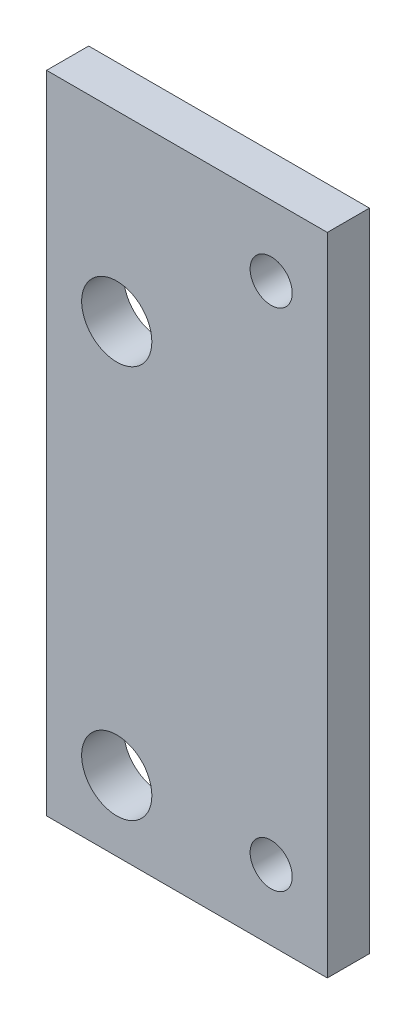
ISO-10303-21;
HEADER;
FILE_DESCRIPTION(('STEP AP214'),'2;1');
FILE_NAME('part.step','',(''),(''),'','','');
FILE_SCHEMA(('AUTOMOTIVE_DESIGN { 1 0 10303 214 1 1 1 1 }'));
ENDSEC;
DATA;
#1=APPLICATION_CONTEXT('core data for automotive mechanical design processes');
#2=APPLICATION_PROTOCOL_DEFINITION('international standard','automotive_design',2000,#1);
#3=PRODUCT_CONTEXT('',#1,'mechanical');
#4=PRODUCT('Part','Part','',(#3));
#5=PRODUCT_RELATED_PRODUCT_CATEGORY('part','',(#4));
#6=PRODUCT_DEFINITION_FORMATION('','',#4);
#7=PRODUCT_DEFINITION_CONTEXT('part definition',#1,'design');
#8=PRODUCT_DEFINITION('design','',#6,#7);
#9=PRODUCT_DEFINITION_SHAPE('','',#8);
#10=(LENGTH_UNIT() NAMED_UNIT(*) SI_UNIT(.MILLI.,.METRE.));
#11=(NAMED_UNIT(*) PLANE_ANGLE_UNIT() SI_UNIT($,.RADIAN.));
#12=(NAMED_UNIT(*) SI_UNIT($,.STERADIAN.) SOLID_ANGLE_UNIT());
#13=UNCERTAINTY_MEASURE_WITH_UNIT(LENGTH_MEASURE(1.E-05),#10,'distance_accuracy_value','');
#14=(GEOMETRIC_REPRESENTATION_CONTEXT(3) GLOBAL_UNCERTAINTY_ASSIGNED_CONTEXT((#13)) GLOBAL_UNIT_ASSIGNED_CONTEXT((#10,
#11,#12)) REPRESENTATION_CONTEXT('',''));
#15=CARTESIAN_POINT('',(0.,0.,0.));
#16=DIRECTION('',(0.,0.,1.));
#17=DIRECTION('',(1.,0.,0.));
#18=AXIS2_PLACEMENT_3D('',#15,#16,#17);
#19=CARTESIAN_POINT('',(0.,46.,3.));
#20=DIRECTION('',(0.,0.,-1.));
#21=DIRECTION('',(-1.,0.,0.));
#22=AXIS2_PLACEMENT_3D('',#19,#20,#21);
#23=PLANE('',#22);
#24=CARTESIAN_POINT('',(16.,41.,3.));
#25=DIRECTION('',(0.,0.,1.));
#26=DIRECTION('',(1.,0.,0.));
#27=AXIS2_PLACEMENT_3D('',#24,#25,#26);
#28=CIRCLE('',#27,1.5);
#29=CARTESIAN_POINT('',(17.5,41.,3.));
#30=VERTEX_POINT('',#29);
#31=EDGE_CURVE('E119',#30,#30,#28,.T.);
#32=ORIENTED_EDGE('',*,*,#31,.F.);
#33=EDGE_LOOP('',(#32));
#34=FACE_BOUND('',#33,.T.);
#35=CARTESIAN_POINT('',(5.,33.,3.));
#36=DIRECTION('',(0.,0.,1.));
#37=DIRECTION('',(1.,0.,0.));
#38=AXIS2_PLACEMENT_3D('',#35,#36,#37);
#39=CIRCLE('',#38,2.5);
#40=CARTESIAN_POINT('',(7.5,33.,3.));
#41=VERTEX_POINT('',#40);
#42=EDGE_CURVE('E98',#41,#41,#39,.T.);
#43=ORIENTED_EDGE('',*,*,#42,.F.);
#44=EDGE_LOOP('',(#43));
#45=FACE_BOUND('',#44,.T.);
#46=DIRECTION('',(0.,-1.,0.));
#47=VECTOR('',#46,1.);
#48=CARTESIAN_POINT('',(0.,0.,3.));
#49=LINE('',#48,#47);
#50=CARTESIAN_POINT('',(0.,46.,3.));
#51=VERTEX_POINT('',#50);
#52=CARTESIAN_POINT('',(0.,0.,3.));
#53=VERTEX_POINT('',#52);
#54=EDGE_CURVE('E83',#51,#53,#49,.T.);
#55=ORIENTED_EDGE('',*,*,#54,.T.);
#56=DIRECTION('',(1.,0.,0.));
#57=VECTOR('',#56,1.);
#58=CARTESIAN_POINT('',(0.,0.,3.));
#59=LINE('',#58,#57);
#60=CARTESIAN_POINT('',(20.,0.,3.));
#61=VERTEX_POINT('',#60);
#62=EDGE_CURVE('E78',#53,#61,#59,.T.);
#63=ORIENTED_EDGE('',*,*,#62,.T.);
#64=DIRECTION('',(0.,1.,0.));
#65=VECTOR('',#64,1.);
#66=CARTESIAN_POINT('',(20.,0.,3.));
#67=LINE('',#66,#65);
#68=CARTESIAN_POINT('',(20.,46.,3.));
#69=VERTEX_POINT('',#68);
#70=EDGE_CURVE('E81',#61,#69,#67,.T.);
#71=ORIENTED_EDGE('',*,*,#70,.T.);
#72=DIRECTION('',(-1.,0.,0.));
#73=VECTOR('',#72,1.);
#74=CARTESIAN_POINT('',(0.,46.,3.));
#75=LINE('',#74,#73);
#76=EDGE_CURVE('E48',#69,#51,#75,.T.);
#77=ORIENTED_EDGE('',*,*,#76,.T.);
#78=EDGE_LOOP('',(#55,#63,#71,#77));
#79=FACE_BOUND('',#78,.T.);
#80=CARTESIAN_POINT('',(5.00000000000001,5.,3.));
#81=DIRECTION('',(0.,0.,1.));
#82=DIRECTION('',(1.,0.,0.));
#83=AXIS2_PLACEMENT_3D('',#80,#81,#82);
#84=CIRCLE('',#83,2.5);
#85=CARTESIAN_POINT('',(7.50000000000001,5.,3.));
#86=VERTEX_POINT('',#85);
#87=EDGE_CURVE('E113',#86,#86,#84,.T.);
#88=ORIENTED_EDGE('',*,*,#87,.F.);
#89=EDGE_LOOP('',(#88));
#90=FACE_BOUND('',#89,.T.);
#91=CARTESIAN_POINT('',(16.,5.,3.));
#92=DIRECTION('',(0.,0.,1.));
#93=DIRECTION('',(-1.,0.,0.));
#94=AXIS2_PLACEMENT_3D('',#91,#92,#93);
#95=CIRCLE('',#94,1.5);
#96=CARTESIAN_POINT('',(14.5,5.,3.));
#97=VERTEX_POINT('',#96);
#98=EDGE_CURVE('E125',#97,#97,#95,.T.);
#99=ORIENTED_EDGE('',*,*,#98,.F.);
#100=EDGE_LOOP('',(#99));
#101=FACE_BOUND('',#100,.T.);
#102=ADVANCED_FACE('F31',(#34,#45,#79,#90,#101),#23,.F.);
#103=CARTESIAN_POINT('',(0.,46.,0.));
#104=DIRECTION('',(0.,0.,-1.));
#105=DIRECTION('',(-1.,0.,0.));
#106=AXIS2_PLACEMENT_3D('',#103,#104,#105);
#107=PLANE('',#106);
#108=CARTESIAN_POINT('',(16.,41.,0.));
#109=DIRECTION('',(0.,0.,1.));
#110=DIRECTION('',(1.,0.,0.));
#111=AXIS2_PLACEMENT_3D('',#108,#109,#110);
#112=CIRCLE('',#111,1.5);
#113=CARTESIAN_POINT('',(17.5,41.,0.));
#114=VERTEX_POINT('',#113);
#115=EDGE_CURVE('E122',#114,#114,#112,.T.);
#116=ORIENTED_EDGE('',*,*,#115,.T.);
#117=EDGE_LOOP('',(#116));
#118=FACE_BOUND('',#117,.T.);
#119=CARTESIAN_POINT('',(5.,33.,0.));
#120=DIRECTION('',(0.,0.,1.));
#121=DIRECTION('',(1.,0.,0.));
#122=AXIS2_PLACEMENT_3D('',#119,#120,#121);
#123=CIRCLE('',#122,2.5);
#124=CARTESIAN_POINT('',(7.5,33.,0.));
#125=VERTEX_POINT('',#124);
#126=EDGE_CURVE('E110',#125,#125,#123,.T.);
#127=ORIENTED_EDGE('',*,*,#126,.T.);
#128=EDGE_LOOP('',(#127));
#129=FACE_BOUND('',#128,.T.);
#130=DIRECTION('',(0.,-1.,0.));
#131=VECTOR('',#130,1.);
#132=CARTESIAN_POINT('',(0.,0.,0.));
#133=LINE('',#132,#131);
#134=CARTESIAN_POINT('',(0.,46.,0.));
#135=VERTEX_POINT('',#134);
#136=CARTESIAN_POINT('',(0.,0.,0.));
#137=VERTEX_POINT('',#136);
#138=EDGE_CURVE('E95',#135,#137,#133,.T.);
#139=ORIENTED_EDGE('',*,*,#138,.F.);
#140=DIRECTION('',(-1.,0.,0.));
#141=VECTOR('',#140,1.);
#142=CARTESIAN_POINT('',(0.,46.,0.));
#143=LINE('',#142,#141);
#144=CARTESIAN_POINT('',(20.,46.,0.));
#145=VERTEX_POINT('',#144);
#146=EDGE_CURVE('E71',#145,#135,#143,.T.);
#147=ORIENTED_EDGE('',*,*,#146,.F.);
#148=DIRECTION('',(0.,1.,0.));
#149=VECTOR('',#148,1.);
#150=CARTESIAN_POINT('',(20.,0.,0.));
#151=LINE('',#150,#149);
#152=CARTESIAN_POINT('',(20.,0.,0.));
#153=VERTEX_POINT('',#152);
#154=EDGE_CURVE('E65',#153,#145,#151,.T.);
#155=ORIENTED_EDGE('',*,*,#154,.F.);
#156=DIRECTION('',(1.,0.,0.));
#157=VECTOR('',#156,1.);
#158=CARTESIAN_POINT('',(0.,0.,0.));
#159=LINE('',#158,#157);
#160=EDGE_CURVE('E87',#137,#153,#159,.T.);
#161=ORIENTED_EDGE('',*,*,#160,.F.);
#162=EDGE_LOOP('',(#139,#147,#155,#161));
#163=FACE_BOUND('',#162,.T.);
#164=CARTESIAN_POINT('',(5.00000000000001,5.,0.));
#165=DIRECTION('',(0.,0.,1.));
#166=DIRECTION('',(1.,0.,0.));
#167=AXIS2_PLACEMENT_3D('',#164,#165,#166);
#168=CIRCLE('',#167,2.5);
#169=CARTESIAN_POINT('',(7.50000000000001,5.,0.));
#170=VERTEX_POINT('',#169);
#171=EDGE_CURVE('E116',#170,#170,#168,.T.);
#172=ORIENTED_EDGE('',*,*,#171,.T.);
#173=EDGE_LOOP('',(#172));
#174=FACE_BOUND('',#173,.T.);
#175=CARTESIAN_POINT('',(16.,5.,0.));
#176=DIRECTION('',(0.,0.,1.));
#177=DIRECTION('',(-1.,0.,0.));
#178=AXIS2_PLACEMENT_3D('',#175,#176,#177);
#179=CIRCLE('',#178,1.5);
#180=CARTESIAN_POINT('',(14.5,5.,0.));
#181=VERTEX_POINT('',#180);
#182=EDGE_CURVE('E128',#181,#181,#179,.T.);
#183=ORIENTED_EDGE('',*,*,#182,.T.);
#184=EDGE_LOOP('',(#183));
#185=FACE_BOUND('',#184,.T.);
#186=ADVANCED_FACE('F106',(#118,#129,#163,#174,#185),#107,.T.);
#187=CARTESIAN_POINT('',(0.,0.,3.));
#188=DIRECTION('',(1.,0.,0.));
#189=DIRECTION('',(0.,0.,-1.));
#190=AXIS2_PLACEMENT_3D('',#187,#188,#189);
#191=PLANE('',#190);
#192=ORIENTED_EDGE('',*,*,#138,.T.);
#193=DIRECTION('',(0.,0.,-1.));
#194=VECTOR('',#193,1.);
#195=CARTESIAN_POINT('',(0.,0.,3.));
#196=LINE('',#195,#194);
#197=EDGE_CURVE('E11',#53,#137,#196,.T.);
#198=ORIENTED_EDGE('',*,*,#197,.F.);
#199=ORIENTED_EDGE('',*,*,#54,.F.);
#200=DIRECTION('',(0.,0.,-1.));
#201=VECTOR('',#200,1.);
#202=CARTESIAN_POINT('',(0.,46.,3.));
#203=LINE('',#202,#201);
#204=EDGE_CURVE('E91',#51,#135,#203,.T.);
#205=ORIENTED_EDGE('',*,*,#204,.T.);
#206=EDGE_LOOP('',(#192,#198,#199,#205));
#207=FACE_BOUND('',#206,.T.);
#208=ADVANCED_FACE('F33',(#207),#191,.F.);
#209=CARTESIAN_POINT('',(0.,0.,3.));
#210=DIRECTION('',(0.,1.,0.));
#211=DIRECTION('',(0.,0.,1.));
#212=AXIS2_PLACEMENT_3D('',#209,#210,#211);
#213=PLANE('',#212);
#214=ORIENTED_EDGE('',*,*,#160,.T.);
#215=DIRECTION('',(0.,0.,-1.));
#216=VECTOR('',#215,1.);
#217=CARTESIAN_POINT('',(20.,0.,3.));
#218=LINE('',#217,#216);
#219=EDGE_CURVE('E40',#61,#153,#218,.T.);
#220=ORIENTED_EDGE('',*,*,#219,.F.);
#221=ORIENTED_EDGE('',*,*,#62,.F.);
#222=ORIENTED_EDGE('',*,*,#197,.T.);
#223=EDGE_LOOP('',(#214,#220,#221,#222));
#224=FACE_BOUND('',#223,.T.);
#225=ADVANCED_FACE('F86',(#224),#213,.F.);
#226=CARTESIAN_POINT('',(20.,0.,3.));
#227=DIRECTION('',(-1.,0.,0.));
#228=DIRECTION('',(0.,0.,1.));
#229=AXIS2_PLACEMENT_3D('',#226,#227,#228);
#230=PLANE('',#229);
#231=ORIENTED_EDGE('',*,*,#154,.T.);
#232=DIRECTION('',(0.,0.,-1.));
#233=VECTOR('',#232,1.);
#234=CARTESIAN_POINT('',(20.,46.,3.));
#235=LINE('',#234,#233);
#236=EDGE_CURVE('E88',#69,#145,#235,.T.);
#237=ORIENTED_EDGE('',*,*,#236,.F.);
#238=ORIENTED_EDGE('',*,*,#70,.F.);
#239=ORIENTED_EDGE('',*,*,#219,.T.);
#240=EDGE_LOOP('',(#231,#237,#238,#239));
#241=FACE_BOUND('',#240,.T.);
#242=ADVANCED_FACE('F89',(#241),#230,.F.);
#243=CARTESIAN_POINT('',(0.,46.,3.));
#244=DIRECTION('',(0.,-1.,0.));
#245=DIRECTION('',(0.,0.,-1.));
#246=AXIS2_PLACEMENT_3D('',#243,#244,#245);
#247=PLANE('',#246);
#248=ORIENTED_EDGE('',*,*,#146,.T.);
#249=ORIENTED_EDGE('',*,*,#204,.F.);
#250=ORIENTED_EDGE('',*,*,#76,.F.);
#251=ORIENTED_EDGE('',*,*,#236,.T.);
#252=EDGE_LOOP('',(#248,#249,#250,#251));
#253=FACE_BOUND('',#252,.T.);
#254=ADVANCED_FACE('F103',(#253),#247,.F.);
#255=CARTESIAN_POINT('',(5.,33.,3.));
#256=DIRECTION('',(0.,0.,-1.));
#257=DIRECTION('',(-1.,0.,0.));
#258=AXIS2_PLACEMENT_3D('',#255,#256,#257);
#259=CYLINDRICAL_SURFACE('',#258,2.5);
#260=ORIENTED_EDGE('',*,*,#42,.T.);
#261=EDGE_LOOP('',(#260));
#262=FACE_BOUND('',#261,.T.);
#263=ORIENTED_EDGE('',*,*,#126,.F.);
#264=EDGE_LOOP('',(#263));
#265=FACE_BOUND('',#264,.T.);
#266=ADVANCED_FACE('F148',(#262,#265),#259,.F.);
#267=CARTESIAN_POINT('',(5.00000000000001,5.,3.));
#268=DIRECTION('',(0.,0.,-1.));
#269=DIRECTION('',(-1.,0.,0.));
#270=AXIS2_PLACEMENT_3D('',#267,#268,#269);
#271=CYLINDRICAL_SURFACE('',#270,2.5);
#272=ORIENTED_EDGE('',*,*,#87,.T.);
#273=EDGE_LOOP('',(#272));
#274=FACE_BOUND('',#273,.T.);
#275=ORIENTED_EDGE('',*,*,#171,.F.);
#276=EDGE_LOOP('',(#275));
#277=FACE_BOUND('',#276,.T.);
#278=ADVANCED_FACE('F194',(#274,#277),#271,.F.);
#279=CARTESIAN_POINT('',(16.,41.,3.));
#280=DIRECTION('',(0.,0.,-1.));
#281=DIRECTION('',(-1.,0.,0.));
#282=AXIS2_PLACEMENT_3D('',#279,#280,#281);
#283=CYLINDRICAL_SURFACE('',#282,1.5);
#284=ORIENTED_EDGE('',*,*,#31,.T.);
#285=EDGE_LOOP('',(#284));
#286=FACE_BOUND('',#285,.T.);
#287=ORIENTED_EDGE('',*,*,#115,.F.);
#288=EDGE_LOOP('',(#287));
#289=FACE_BOUND('',#288,.T.);
#290=ADVANCED_FACE('F202',(#286,#289),#283,.F.);
#291=CARTESIAN_POINT('',(16.,5.,3.));
#292=DIRECTION('',(0.,0.,-1.));
#293=DIRECTION('',(-1.,0.,0.));
#294=AXIS2_PLACEMENT_3D('',#291,#292,#293);
#295=CYLINDRICAL_SURFACE('',#294,1.5);
#296=ORIENTED_EDGE('',*,*,#98,.T.);
#297=EDGE_LOOP('',(#296));
#298=FACE_BOUND('',#297,.T.);
#299=ORIENTED_EDGE('',*,*,#182,.F.);
#300=EDGE_LOOP('',(#299));
#301=FACE_BOUND('',#300,.T.);
#302=ADVANCED_FACE('F134',(#298,#301),#295,.F.);
#303=CLOSED_SHELL('',(#102,#186,#208,#225,#242,#254,#266,#278,#290,#302));
#304=MANIFOLD_SOLID_BREP('B2',#303);
#305=ADVANCED_BREP_SHAPE_REPRESENTATION('',(#18,#304),#14);
#306=SHAPE_DEFINITION_REPRESENTATION(#9,#305);
ENDSEC;
END-ISO-10303-21;
